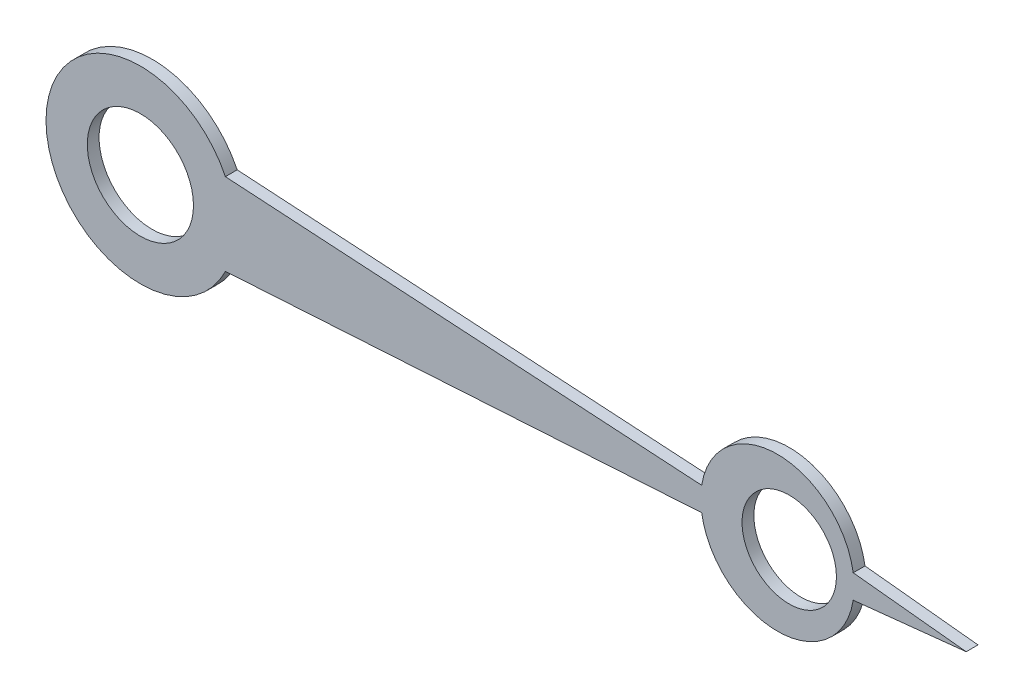
ISO-10303-21;
HEADER;
FILE_DESCRIPTION(('STEP AP214'),'2;1');
FILE_NAME('part.step','',(''),(''),'','','');
FILE_SCHEMA(('AUTOMOTIVE_DESIGN { 1 0 10303 214 1 1 1 1 }'));
ENDSEC;
DATA;
#1=APPLICATION_CONTEXT('core data for automotive mechanical design processes');
#2=APPLICATION_PROTOCOL_DEFINITION('international standard','automotive_design',2000,#1);
#3=PRODUCT_CONTEXT('',#1,'mechanical');
#4=PRODUCT('Part','Part','',(#3));
#5=PRODUCT_RELATED_PRODUCT_CATEGORY('part','',(#4));
#6=PRODUCT_DEFINITION_FORMATION('','',#4);
#7=PRODUCT_DEFINITION_CONTEXT('part definition',#1,'design');
#8=PRODUCT_DEFINITION('design','',#6,#7);
#9=PRODUCT_DEFINITION_SHAPE('','',#8);
#10=(LENGTH_UNIT() NAMED_UNIT(*) SI_UNIT(.MILLI.,.METRE.));
#11=(NAMED_UNIT(*) PLANE_ANGLE_UNIT() SI_UNIT($,.RADIAN.));
#12=(NAMED_UNIT(*) SI_UNIT($,.STERADIAN.) SOLID_ANGLE_UNIT());
#13=UNCERTAINTY_MEASURE_WITH_UNIT(LENGTH_MEASURE(1.E-05),#10,'distance_accuracy_value','');
#14=(GEOMETRIC_REPRESENTATION_CONTEXT(3) GLOBAL_UNCERTAINTY_ASSIGNED_CONTEXT((#13)) GLOBAL_UNIT_ASSIGNED_CONTEXT((#10,
#11,#12)) REPRESENTATION_CONTEXT('',''));
#15=CARTESIAN_POINT('',(0.,0.,0.));
#16=DIRECTION('',(0.,0.,1.));
#17=DIRECTION('',(1.,0.,0.));
#18=AXIS2_PLACEMENT_3D('',#15,#16,#17);
#19=CARTESIAN_POINT('',(54.,0.,20.));
#20=DIRECTION('',(0.,0.,1.));
#21=DIRECTION('',(1.,0.,0.));
#22=AXIS2_PLACEMENT_3D('',#19,#20,#21);
#23=PLANE('',#22);
#24=CARTESIAN_POINT('',(55.,0.,20.));
#25=DIRECTION('',(0.,0.,1.));
#26=DIRECTION('',(1.,0.,0.));
#27=AXIS2_PLACEMENT_3D('',#24,#25,#26);
#28=CIRCLE('',#27,3.99999999999999);
#29=CARTESIAN_POINT('',(59.,0.,20.));
#30=VERTEX_POINT('',#29);
#31=EDGE_CURVE('E129',#30,#30,#28,.T.);
#32=ORIENTED_EDGE('',*,*,#31,.F.);
#33=EDGE_LOOP('',(#32));
#34=FACE_BOUND('',#33,.T.);
#35=DIRECTION('',(0.994521895368273,0.104528463267654,0.));
#36=VECTOR('',#35,1.);
#37=CARTESIAN_POINT('',(60.4215641633167,-1.00673417365595,20.));
#38=LINE('',#37,#36);
#39=CARTESIAN_POINT('',(60.4215641633167,-1.00673417365595,20.));
#40=VERTEX_POINT('',#39);
#41=CARTESIAN_POINT('',(70.,0.,20.));
#42=VERTEX_POINT('',#41);
#43=EDGE_CURVE('E138',#40,#42,#38,.T.);
#44=ORIENTED_EDGE('',*,*,#43,.T.);
#45=DIRECTION('',(-0.994521895368273,0.104528463267655,0.));
#46=VECTOR('',#45,1.);
#47=CARTESIAN_POINT('',(60.4215641633167,1.00673417365596,20.));
#48=LINE('',#47,#46);
#49=CARTESIAN_POINT('',(60.4215641633167,1.00673417365596,20.));
#50=VERTEX_POINT('',#49);
#51=EDGE_CURVE('E91',#42,#50,#48,.T.);
#52=ORIENTED_EDGE('',*,*,#51,.T.);
#53=CARTESIAN_POINT('',(54.,0.,20.));
#54=DIRECTION('',(0.,0.,1.));
#55=DIRECTION('',(1.,0.,0.));
#56=AXIS2_PLACEMENT_3D('',#53,#54,#55);
#57=CIRCLE('',#56,6.5);
#58=CARTESIAN_POINT('',(47.5784358366833,1.00673417365596,20.));
#59=VERTEX_POINT('',#58);
#60=EDGE_CURVE('E150',#50,#59,#57,.T.);
#61=ORIENTED_EDGE('',*,*,#60,.T.);
#62=DIRECTION('',(-0.998134798421867,0.06104853953485,0.));
#63=VECTOR('',#62,1.);
#64=CARTESIAN_POINT('',(47.5784358366833,1.00673417365596,20.));
#65=LINE('',#64,#63);
#66=CARTESIAN_POINT('',(7.20534663535571,3.4760580927781,20.));
#67=VERTEX_POINT('',#66);
#68=EDGE_CURVE('E107',#59,#67,#65,.T.);
#69=ORIENTED_EDGE('',*,*,#68,.T.);
#70=CARTESIAN_POINT('',(0.,0.,20.));
#71=DIRECTION('',(0.,0.,1.));
#72=DIRECTION('',(1.,0.,0.));
#73=AXIS2_PLACEMENT_3D('',#70,#71,#72);
#74=CIRCLE('',#73,8.);
#75=CARTESIAN_POINT('',(7.20534663535571,-3.4760580927781,20.));
#76=VERTEX_POINT('',#75);
#77=EDGE_CURVE('E101',#67,#76,#74,.T.);
#78=ORIENTED_EDGE('',*,*,#77,.T.);
#79=DIRECTION('',(0.998134798421867,0.0610485395348501,0.));
#80=VECTOR('',#79,1.);
#81=CARTESIAN_POINT('',(47.5784358366833,-1.00673417365595,20.));
#82=LINE('',#81,#80);
#83=CARTESIAN_POINT('',(47.5784358366833,-1.00673417365595,20.));
#84=VERTEX_POINT('',#83);
#85=EDGE_CURVE('E105',#76,#84,#82,.T.);
#86=ORIENTED_EDGE('',*,*,#85,.T.);
#87=CARTESIAN_POINT('',(54.,0.,20.));
#88=DIRECTION('',(0.,0.,1.));
#89=DIRECTION('',(1.,0.,0.));
#90=AXIS2_PLACEMENT_3D('',#87,#88,#89);
#91=CIRCLE('',#90,6.5);
#92=EDGE_CURVE('E51',#84,#40,#91,.T.);
#93=ORIENTED_EDGE('',*,*,#92,.T.);
#94=EDGE_LOOP('',(#44,#52,#61,#69,#78,#86,#93));
#95=FACE_BOUND('',#94,.T.);
#96=CARTESIAN_POINT('',(0.,0.,20.));
#97=DIRECTION('',(0.,0.,1.));
#98=DIRECTION('',(1.,0.,0.));
#99=AXIS2_PLACEMENT_3D('',#96,#97,#98);
#100=CIRCLE('',#99,4.5);
#101=CARTESIAN_POINT('',(4.5,0.,20.));
#102=VERTEX_POINT('',#101);
#103=EDGE_CURVE('E165',#102,#102,#100,.T.);
#104=ORIENTED_EDGE('',*,*,#103,.F.);
#105=EDGE_LOOP('',(#104));
#106=FACE_BOUND('',#105,.T.);
#107=ADVANCED_FACE('F34',(#34,#95,#106),#23,.T.);
#108=CARTESIAN_POINT('',(54.,0.,19.));
#109=DIRECTION('',(0.,0.,1.));
#110=DIRECTION('',(1.,0.,0.));
#111=AXIS2_PLACEMENT_3D('',#108,#109,#110);
#112=PLANE('',#111);
#113=DIRECTION('',(0.994521895368273,0.104528463267654,0.));
#114=VECTOR('',#113,1.);
#115=CARTESIAN_POINT('',(60.4215641633167,-1.00673417365595,19.));
#116=LINE('',#115,#114);
#117=CARTESIAN_POINT('',(60.4215641633167,-1.00673417365595,19.));
#118=VERTEX_POINT('',#117);
#119=CARTESIAN_POINT('',(70.,0.,19.));
#120=VERTEX_POINT('',#119);
#121=EDGE_CURVE('E125',#118,#120,#116,.T.);
#122=ORIENTED_EDGE('',*,*,#121,.F.);
#123=CARTESIAN_POINT('',(54.,0.,19.));
#124=DIRECTION('',(0.,0.,1.));
#125=DIRECTION('',(1.,0.,0.));
#126=AXIS2_PLACEMENT_3D('',#123,#124,#125);
#127=CIRCLE('',#126,6.5);
#128=CARTESIAN_POINT('',(47.5784358366833,-1.00673417365595,19.));
#129=VERTEX_POINT('',#128);
#130=EDGE_CURVE('E83',#129,#118,#127,.T.);
#131=ORIENTED_EDGE('',*,*,#130,.F.);
#132=DIRECTION('',(0.998134798421867,0.0610485395348501,0.));
#133=VECTOR('',#132,1.);
#134=CARTESIAN_POINT('',(47.5784358366833,-1.00673417365595,19.));
#135=LINE('',#134,#133);
#136=CARTESIAN_POINT('',(7.20534663535571,-3.4760580927781,19.));
#137=VERTEX_POINT('',#136);
#138=EDGE_CURVE('E77',#137,#129,#135,.T.);
#139=ORIENTED_EDGE('',*,*,#138,.F.);
#140=CARTESIAN_POINT('',(0.,0.,19.));
#141=DIRECTION('',(0.,0.,1.));
#142=DIRECTION('',(1.,0.,0.));
#143=AXIS2_PLACEMENT_3D('',#140,#141,#142);
#144=CIRCLE('',#143,8.);
#145=CARTESIAN_POINT('',(7.20534663535571,3.4760580927781,19.));
#146=VERTEX_POINT('',#145);
#147=EDGE_CURVE('E115',#146,#137,#144,.T.);
#148=ORIENTED_EDGE('',*,*,#147,.F.);
#149=DIRECTION('',(-0.998134798421867,0.06104853953485,0.));
#150=VECTOR('',#149,1.);
#151=CARTESIAN_POINT('',(47.5784358366833,1.00673417365596,19.));
#152=LINE('',#151,#150);
#153=CARTESIAN_POINT('',(47.5784358366833,1.00673417365596,19.));
#154=VERTEX_POINT('',#153);
#155=EDGE_CURVE('E133',#154,#146,#152,.T.);
#156=ORIENTED_EDGE('',*,*,#155,.F.);
#157=CARTESIAN_POINT('',(54.,0.,19.));
#158=DIRECTION('',(0.,0.,1.));
#159=DIRECTION('',(1.,0.,0.));
#160=AXIS2_PLACEMENT_3D('',#157,#158,#159);
#161=CIRCLE('',#160,6.5);
#162=CARTESIAN_POINT('',(60.4215641633167,1.00673417365596,19.));
#163=VERTEX_POINT('',#162);
#164=EDGE_CURVE('E131',#163,#154,#161,.T.);
#165=ORIENTED_EDGE('',*,*,#164,.F.);
#166=DIRECTION('',(-0.994521895368273,0.104528463267655,0.));
#167=VECTOR('',#166,1.);
#168=CARTESIAN_POINT('',(60.4215641633167,1.00673417365596,19.));
#169=LINE('',#168,#167);
#170=EDGE_CURVE('E128',#120,#163,#169,.T.);
#171=ORIENTED_EDGE('',*,*,#170,.F.);
#172=EDGE_LOOP('',(#122,#131,#139,#148,#156,#165,#171));
#173=FACE_BOUND('',#172,.T.);
#174=CARTESIAN_POINT('',(55.,0.,19.));
#175=DIRECTION('',(0.,0.,1.));
#176=DIRECTION('',(1.,0.,0.));
#177=AXIS2_PLACEMENT_3D('',#174,#175,#176);
#178=CIRCLE('',#177,3.99999999999999);
#179=CARTESIAN_POINT('',(59.,0.,19.));
#180=VERTEX_POINT('',#179);
#181=EDGE_CURVE('E162',#180,#180,#178,.T.);
#182=ORIENTED_EDGE('',*,*,#181,.T.);
#183=EDGE_LOOP('',(#182));
#184=FACE_BOUND('',#183,.T.);
#185=CARTESIAN_POINT('',(0.,0.,19.));
#186=DIRECTION('',(0.,0.,1.));
#187=DIRECTION('',(1.,0.,0.));
#188=AXIS2_PLACEMENT_3D('',#185,#186,#187);
#189=CIRCLE('',#188,4.5);
#190=CARTESIAN_POINT('',(4.5,0.,19.));
#191=VERTEX_POINT('',#190);
#192=EDGE_CURVE('E168',#191,#191,#189,.T.);
#193=ORIENTED_EDGE('',*,*,#192,.T.);
#194=EDGE_LOOP('',(#193));
#195=FACE_BOUND('',#194,.T.);
#196=ADVANCED_FACE('F154',(#173,#184,#195),#112,.F.);
#197=CARTESIAN_POINT('',(60.4215641633167,-1.00673417365595,20.));
#198=DIRECTION('',(-0.104528463267654,0.994521895368273,0.));
#199=DIRECTION('',(-0.994521895368273,-0.104528463267654,0.));
#200=AXIS2_PLACEMENT_3D('',#197,#198,#199);
#201=PLANE('',#200);
#202=ORIENTED_EDGE('',*,*,#121,.T.);
#203=DIRECTION('',(0.,0.,-1.));
#204=VECTOR('',#203,1.);
#205=CARTESIAN_POINT('',(70.,0.,20.));
#206=LINE('',#205,#204);
#207=EDGE_CURVE('E11',#42,#120,#206,.T.);
#208=ORIENTED_EDGE('',*,*,#207,.F.);
#209=ORIENTED_EDGE('',*,*,#43,.F.);
#210=DIRECTION('',(0.,0.,-1.));
#211=VECTOR('',#210,1.);
#212=CARTESIAN_POINT('',(60.4215641633167,-1.00673417365595,20.));
#213=LINE('',#212,#211);
#214=EDGE_CURVE('E121',#40,#118,#213,.T.);
#215=ORIENTED_EDGE('',*,*,#214,.T.);
#216=EDGE_LOOP('',(#202,#208,#209,#215));
#217=FACE_BOUND('',#216,.T.);
#218=ADVANCED_FACE('F36',(#217),#201,.F.);
#219=CARTESIAN_POINT('',(60.4215641633167,1.00673417365596,20.));
#220=DIRECTION('',(-0.104528463267655,-0.994521895368273,0.));
#221=DIRECTION('',(0.994521895368273,-0.104528463267655,0.));
#222=AXIS2_PLACEMENT_3D('',#219,#220,#221);
#223=PLANE('',#222);
#224=ORIENTED_EDGE('',*,*,#170,.T.);
#225=DIRECTION('',(0.,0.,-1.));
#226=VECTOR('',#225,1.);
#227=CARTESIAN_POINT('',(60.4215641633167,1.00673417365596,20.));
#228=LINE('',#227,#226);
#229=EDGE_CURVE('E43',#50,#163,#228,.T.);
#230=ORIENTED_EDGE('',*,*,#229,.F.);
#231=ORIENTED_EDGE('',*,*,#51,.F.);
#232=ORIENTED_EDGE('',*,*,#207,.T.);
#233=EDGE_LOOP('',(#224,#230,#231,#232));
#234=FACE_BOUND('',#233,.T.);
#235=ADVANCED_FACE('F198',(#234),#223,.F.);
#236=CARTESIAN_POINT('',(54.,0.,20.));
#237=DIRECTION('',(0.,0.,-1.));
#238=DIRECTION('',(-1.,0.,0.));
#239=AXIS2_PLACEMENT_3D('',#236,#237,#238);
#240=CYLINDRICAL_SURFACE('',#239,6.5);
#241=ORIENTED_EDGE('',*,*,#164,.T.);
#242=DIRECTION('',(0.,0.,-1.));
#243=VECTOR('',#242,1.);
#244=CARTESIAN_POINT('',(47.5784358366833,1.00673417365596,20.));
#245=LINE('',#244,#243);
#246=EDGE_CURVE('E142',#59,#154,#245,.T.);
#247=ORIENTED_EDGE('',*,*,#246,.F.);
#248=ORIENTED_EDGE('',*,*,#60,.F.);
#249=ORIENTED_EDGE('',*,*,#229,.T.);
#250=EDGE_LOOP('',(#241,#247,#248,#249));
#251=FACE_BOUND('',#250,.T.);
#252=ADVANCED_FACE('F148',(#251),#240,.T.);
#253=CARTESIAN_POINT('',(47.5784358366833,1.00673417365596,20.));
#254=DIRECTION('',(-0.06104853953485,-0.998134798421867,0.));
#255=DIRECTION('',(0.998134798421867,-0.06104853953485,0.));
#256=AXIS2_PLACEMENT_3D('',#253,#254,#255);
#257=PLANE('',#256);
#258=ORIENTED_EDGE('',*,*,#155,.T.);
#259=DIRECTION('',(0.,0.,-1.));
#260=VECTOR('',#259,1.);
#261=CARTESIAN_POINT('',(7.20534663535571,3.4760580927781,20.));
#262=LINE('',#261,#260);
#263=EDGE_CURVE('E116',#67,#146,#262,.T.);
#264=ORIENTED_EDGE('',*,*,#263,.F.);
#265=ORIENTED_EDGE('',*,*,#68,.F.);
#266=ORIENTED_EDGE('',*,*,#246,.T.);
#267=EDGE_LOOP('',(#258,#264,#265,#266));
#268=FACE_BOUND('',#267,.T.);
#269=ADVANCED_FACE('F157',(#268),#257,.F.);
#270=CARTESIAN_POINT('',(0.,0.,20.));
#271=DIRECTION('',(0.,0.,-1.));
#272=DIRECTION('',(-1.,0.,0.));
#273=AXIS2_PLACEMENT_3D('',#270,#271,#272);
#274=CYLINDRICAL_SURFACE('',#273,8.);
#275=ORIENTED_EDGE('',*,*,#147,.T.);
#276=DIRECTION('',(0.,0.,-1.));
#277=VECTOR('',#276,1.);
#278=CARTESIAN_POINT('',(7.20534663535571,-3.4760580927781,20.));
#279=LINE('',#278,#277);
#280=EDGE_CURVE('E112',#76,#137,#279,.T.);
#281=ORIENTED_EDGE('',*,*,#280,.F.);
#282=ORIENTED_EDGE('',*,*,#77,.F.);
#283=ORIENTED_EDGE('',*,*,#263,.T.);
#284=EDGE_LOOP('',(#275,#281,#282,#283));
#285=FACE_BOUND('',#284,.T.);
#286=ADVANCED_FACE('F113',(#285),#274,.T.);
#287=CARTESIAN_POINT('',(47.5784358366833,-1.00673417365595,20.));
#288=DIRECTION('',(-0.0610485395348501,0.998134798421867,0.));
#289=DIRECTION('',(-0.998134798421867,-0.0610485395348501,0.));
#290=AXIS2_PLACEMENT_3D('',#287,#288,#289);
#291=PLANE('',#290);
#292=ORIENTED_EDGE('',*,*,#138,.T.);
#293=DIRECTION('',(0.,0.,-1.));
#294=VECTOR('',#293,1.);
#295=CARTESIAN_POINT('',(47.5784358366833,-1.00673417365595,20.));
#296=LINE('',#295,#294);
#297=EDGE_CURVE('E117',#84,#129,#296,.T.);
#298=ORIENTED_EDGE('',*,*,#297,.F.);
#299=ORIENTED_EDGE('',*,*,#85,.F.);
#300=ORIENTED_EDGE('',*,*,#280,.T.);
#301=EDGE_LOOP('',(#292,#298,#299,#300));
#302=FACE_BOUND('',#301,.T.);
#303=ADVANCED_FACE('F119',(#302),#291,.F.);
#304=CARTESIAN_POINT('',(54.,0.,20.));
#305=DIRECTION('',(0.,0.,-1.));
#306=DIRECTION('',(-1.,0.,0.));
#307=AXIS2_PLACEMENT_3D('',#304,#305,#306);
#308=CYLINDRICAL_SURFACE('',#307,6.5);
#309=ORIENTED_EDGE('',*,*,#130,.T.);
#310=ORIENTED_EDGE('',*,*,#214,.F.);
#311=ORIENTED_EDGE('',*,*,#92,.F.);
#312=ORIENTED_EDGE('',*,*,#297,.T.);
#313=EDGE_LOOP('',(#309,#310,#311,#312));
#314=FACE_BOUND('',#313,.T.);
#315=ADVANCED_FACE('F188',(#314),#308,.T.);
#316=CARTESIAN_POINT('',(55.,0.,20.));
#317=DIRECTION('',(0.,0.,-1.));
#318=DIRECTION('',(-1.,0.,0.));
#319=AXIS2_PLACEMENT_3D('',#316,#317,#318);
#320=CYLINDRICAL_SURFACE('',#319,3.99999999999999);
#321=ORIENTED_EDGE('',*,*,#31,.T.);
#322=EDGE_LOOP('',(#321));
#323=FACE_BOUND('',#322,.T.);
#324=ORIENTED_EDGE('',*,*,#181,.F.);
#325=EDGE_LOOP('',(#324));
#326=FACE_BOUND('',#325,.T.);
#327=ADVANCED_FACE('F185',(#323,#326),#320,.F.);
#328=CARTESIAN_POINT('',(0.,0.,20.));
#329=DIRECTION('',(0.,0.,-1.));
#330=DIRECTION('',(-1.,0.,0.));
#331=AXIS2_PLACEMENT_3D('',#328,#329,#330);
#332=CYLINDRICAL_SURFACE('',#331,4.5);
#333=ORIENTED_EDGE('',*,*,#103,.T.);
#334=EDGE_LOOP('',(#333));
#335=FACE_BOUND('',#334,.T.);
#336=ORIENTED_EDGE('',*,*,#192,.F.);
#337=EDGE_LOOP('',(#336));
#338=FACE_BOUND('',#337,.T.);
#339=ADVANCED_FACE('F174',(#335,#338),#332,.F.);
#340=CLOSED_SHELL('',(#107,#196,#218,#235,#252,#269,#286,#303,#315,#327,#339));
#341=MANIFOLD_SOLID_BREP('B2',#340);
#342=ADVANCED_BREP_SHAPE_REPRESENTATION('',(#18,#341),#14);
#343=SHAPE_DEFINITION_REPRESENTATION(#9,#342);
ENDSEC;
END-ISO-10303-21;
